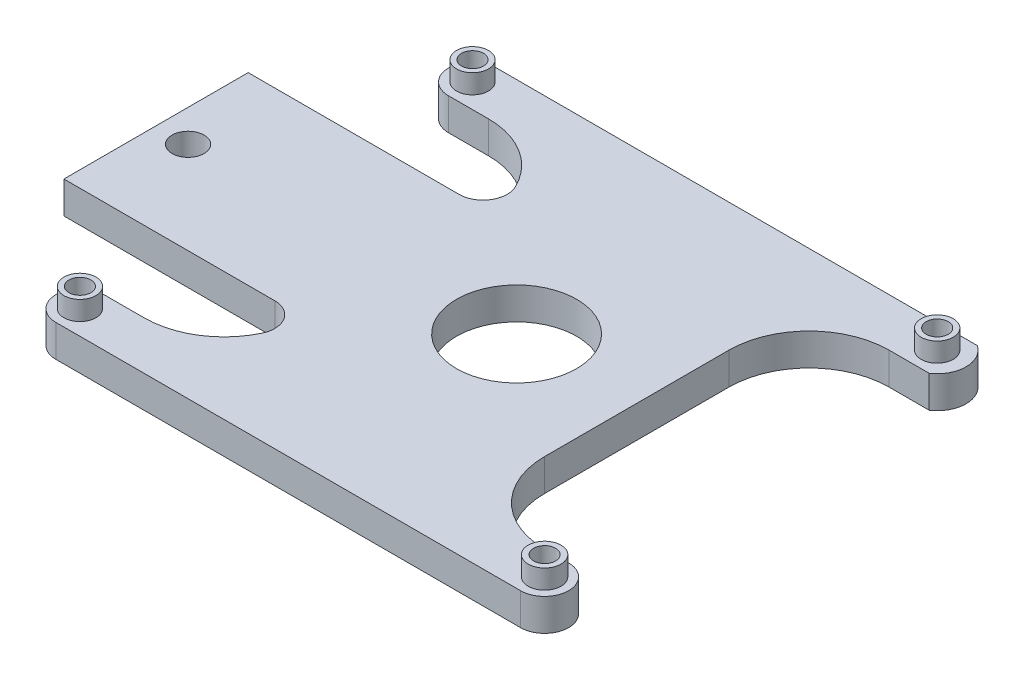
ISO-10303-21;
HEADER;
FILE_DESCRIPTION(('STEP AP214'),'2;1');
FILE_NAME('part.step','',(''),(''),'','','');
FILE_SCHEMA(('AUTOMOTIVE_DESIGN { 1 0 10303 214 1 1 1 1 }'));
ENDSEC;
DATA;
#1=APPLICATION_CONTEXT('core data for automotive mechanical design processes');
#2=APPLICATION_PROTOCOL_DEFINITION('international standard','automotive_design',2000,#1);
#3=PRODUCT_CONTEXT('',#1,'mechanical');
#4=PRODUCT('Part','Part','',(#3));
#5=PRODUCT_RELATED_PRODUCT_CATEGORY('part','',(#4));
#6=PRODUCT_DEFINITION_FORMATION('','',#4);
#7=PRODUCT_DEFINITION_CONTEXT('part definition',#1,'design');
#8=PRODUCT_DEFINITION('design','',#6,#7);
#9=PRODUCT_DEFINITION_SHAPE('','',#8);
#10=(LENGTH_UNIT() NAMED_UNIT(*) SI_UNIT(.MILLI.,.METRE.));
#11=(NAMED_UNIT(*) PLANE_ANGLE_UNIT() SI_UNIT($,.RADIAN.));
#12=(NAMED_UNIT(*) SI_UNIT($,.STERADIAN.) SOLID_ANGLE_UNIT());
#13=UNCERTAINTY_MEASURE_WITH_UNIT(LENGTH_MEASURE(1.E-05),#10,'distance_accuracy_value','');
#14=(GEOMETRIC_REPRESENTATION_CONTEXT(3) GLOBAL_UNCERTAINTY_ASSIGNED_CONTEXT((#13)) GLOBAL_UNIT_ASSIGNED_CONTEXT((#10,
#11,#12)) REPRESENTATION_CONTEXT('',''));
#15=CARTESIAN_POINT('',(0.,0.,0.));
#16=DIRECTION('',(0.,0.,1.));
#17=DIRECTION('',(1.,0.,0.));
#18=AXIS2_PLACEMENT_3D('',#15,#16,#17);
#19=CARTESIAN_POINT('',(0.,4.,0.));
#20=DIRECTION('',(0.,1.,0.));
#21=DIRECTION('',(0.,0.,1.));
#22=AXIS2_PLACEMENT_3D('',#19,#20,#21);
#23=PLANE('',#22);
#24=CARTESIAN_POINT('',(41.2403562828165,4.,9.44125715526372));
#25=DIRECTION('',(0.,1.,0.));
#26=DIRECTION('',(0.,0.,1.));
#27=AXIS2_PLACEMENT_3D('',#24,#25,#26);
#28=CIRCLE('',#27,2.05021911453277);
#29=CARTESIAN_POINT('',(41.2403562828165,4.,11.4914762697965));
#30=VERTEX_POINT('',#29);
#31=EDGE_CURVE('E370',#30,#30,#28,.T.);
#32=ORIENTED_EDGE('',*,*,#31,.F.);
#33=EDGE_LOOP('',(#32));
#34=FACE_BOUND('',#33,.T.);
#35=CARTESIAN_POINT('',(-16.7596437171835,4.,-39.5587428447363));
#36=DIRECTION('',(0.,1.,0.));
#37=DIRECTION('',(0.,0.,1.));
#38=AXIS2_PLACEMENT_3D('',#35,#36,#37);
#39=CIRCLE('',#38,1.9951056342779);
#40=CARTESIAN_POINT('',(-16.7596437171835,4.,-37.5636372104584));
#41=VERTEX_POINT('',#40);
#42=EDGE_CURVE('E388',#41,#41,#39,.T.);
#43=ORIENTED_EDGE('',*,*,#42,.F.);
#44=EDGE_LOOP('',(#43));
#45=FACE_BOUND('',#44,.T.);
#46=CARTESIAN_POINT('',(-27.7596437171835,4.,-15.0587428447362));
#47=DIRECTION('',(0.,1.,0.));
#48=DIRECTION('',(0.,0.,1.));
#49=AXIS2_PLACEMENT_3D('',#46,#47,#48);
#50=CIRCLE('',#49,2.00000000000001);
#51=CARTESIAN_POINT('',(-27.7596437171835,4.,-13.0587428447362));
#52=VERTEX_POINT('',#51);
#53=EDGE_CURVE('E392',#52,#52,#50,.T.);
#54=ORIENTED_EDGE('',*,*,#53,.F.);
#55=EDGE_LOOP('',(#54));
#56=FACE_BOUND('',#55,.T.);
#57=CARTESIAN_POINT('',(13.2403562828165,4.,-15.0587428447363));
#58=DIRECTION('',(0.,1.,0.));
#59=DIRECTION('',(0.,0.,1.));
#60=AXIS2_PLACEMENT_3D('',#57,#58,#59);
#61=CIRCLE('',#60,7.5);
#62=CARTESIAN_POINT('',(13.2403562828165,4.,-7.55874284473629));
#63=VERTEX_POINT('',#62);
#64=EDGE_CURVE('E275',#63,#63,#61,.T.);
#65=ORIENTED_EDGE('',*,*,#64,.F.);
#66=EDGE_LOOP('',(#65));
#67=FACE_BOUND('',#66,.T.);
#68=CARTESIAN_POINT('',(-11.7596437171835,4.,-26.5587428447363));
#69=DIRECTION('',(0.,1.,0.));
#70=DIRECTION('',(0.,0.,1.));
#71=AXIS2_PLACEMENT_3D('',#68,#69,#70);
#72=CIRCLE('',#71,10.);
#73=CARTESIAN_POINT('',(-2.72456468813099,4.,-30.8444571304505));
#74=VERTEX_POINT('',#73);
#75=CARTESIAN_POINT('',(-11.7596437171836,4.,-36.5587428447363));
#76=VERTEX_POINT('',#75);
#77=EDGE_CURVE('E399',#74,#76,#72,.T.);
#78=ORIENTED_EDGE('',*,*,#77,.F.);
#79=CARTESIAN_POINT('',(-5.43508839684676,4.,-29.5587428447362));
#80=DIRECTION('',(0.,1.,0.));
#81=DIRECTION('',(0.,0.,1.));
#82=AXIS2_PLACEMENT_3D('',#79,#80,#81);
#83=CIRCLE('',#82,3.);
#84=CARTESIAN_POINT('',(-5.43508839684676,4.,-26.5587428447362));
#85=VERTEX_POINT('',#84);
#86=EDGE_CURVE('E401',#74,#85,#83,.F.);
#87=ORIENTED_EDGE('',*,*,#86,.T.);
#88=DIRECTION('',(-1.,0.,0.));
#89=VECTOR('',#88,1.);
#90=CARTESIAN_POINT('',(0.,4.,-26.5587428447362));
#91=LINE('',#90,#89);
#92=CARTESIAN_POINT('',(-31.7596437171835,4.,-26.5587428447363));
#93=VERTEX_POINT('',#92);
#94=EDGE_CURVE('E316',#85,#93,#91,.T.);
#95=ORIENTED_EDGE('',*,*,#94,.T.);
#96=DIRECTION('',(0.,0.,-1.));
#97=VECTOR('',#96,1.);
#98=CARTESIAN_POINT('',(-31.7596437171835,4.,0.));
#99=LINE('',#98,#97);
#100=CARTESIAN_POINT('',(-31.7596437171835,4.,-3.55874284473629));
#101=VERTEX_POINT('',#100);
#102=EDGE_CURVE('E404',#101,#93,#99,.T.);
#103=ORIENTED_EDGE('',*,*,#102,.F.);
#104=DIRECTION('',(1.,0.,0.));
#105=VECTOR('',#104,1.);
#106=CARTESIAN_POINT('',(0.,4.,-3.55874284473629));
#107=LINE('',#106,#105);
#108=CARTESIAN_POINT('',(-5.43508839684676,4.,-3.55874284473635));
#109=VERTEX_POINT('',#108);
#110=EDGE_CURVE('E407',#101,#109,#107,.T.);
#111=ORIENTED_EDGE('',*,*,#110,.T.);
#112=CARTESIAN_POINT('',(-5.43508839684675,4.,-0.55874284473635));
#113=DIRECTION('',(0.,1.,0.));
#114=DIRECTION('',(0.,0.,1.));
#115=AXIS2_PLACEMENT_3D('',#112,#113,#114);
#116=CIRCLE('',#115,3.);
#117=CARTESIAN_POINT('',(-2.72456468813099,4.,0.726971440977909));
#118=VERTEX_POINT('',#117);
#119=EDGE_CURVE('E409',#118,#109,#116,.T.);
#120=ORIENTED_EDGE('',*,*,#119,.F.);
#121=CARTESIAN_POINT('',(-11.7596437171835,4.,-3.55874284473628));
#122=DIRECTION('',(0.,1.,0.));
#123=DIRECTION('',(0.,0.,1.));
#124=AXIS2_PLACEMENT_3D('',#121,#122,#123);
#125=CIRCLE('',#124,10.);
#126=CARTESIAN_POINT('',(-11.7596437171836,4.,6.44125715526371));
#127=VERTEX_POINT('',#126);
#128=EDGE_CURVE('E412',#127,#118,#125,.T.);
#129=ORIENTED_EDGE('',*,*,#128,.F.);
#130=DIRECTION('',(1.,0.,0.));
#131=VECTOR('',#130,1.);
#132=CARTESIAN_POINT('',(0.,4.,6.44125715526371));
#133=LINE('',#132,#131);
#134=CARTESIAN_POINT('',(-16.7596437171835,4.,6.44125715526371));
#135=VERTEX_POINT('',#134);
#136=EDGE_CURVE('E415',#135,#127,#133,.T.);
#137=ORIENTED_EDGE('',*,*,#136,.F.);
#138=CARTESIAN_POINT('',(-16.7596437171835,4.,9.44125715526371));
#139=DIRECTION('',(0.,1.,0.));
#140=DIRECTION('',(0.,0.,1.));
#141=AXIS2_PLACEMENT_3D('',#138,#139,#140);
#142=CIRCLE('',#141,3.);
#143=CARTESIAN_POINT('',(-16.7596437171835,4.,12.4412571552637));
#144=VERTEX_POINT('',#143);
#145=EDGE_CURVE('E418',#135,#144,#142,.T.);
#146=ORIENTED_EDGE('',*,*,#145,.T.);
#147=DIRECTION('',(1.,0.,0.));
#148=VECTOR('',#147,1.);
#149=CARTESIAN_POINT('',(0.,4.,12.4412571552637));
#150=LINE('',#149,#148);
#151=CARTESIAN_POINT('',(41.2403562828165,4.,12.4412571552637));
#152=VERTEX_POINT('',#151);
#153=EDGE_CURVE('E421',#144,#152,#150,.T.);
#154=ORIENTED_EDGE('',*,*,#153,.T.);
#155=CARTESIAN_POINT('',(41.2403562828165,4.,9.44125715526372));
#156=DIRECTION('',(0.,1.,0.));
#157=DIRECTION('',(0.,0.,1.));
#158=AXIS2_PLACEMENT_3D('',#155,#156,#157);
#159=CIRCLE('',#158,3.);
#160=CARTESIAN_POINT('',(41.2403562828165,4.,6.44125715526372));
#161=VERTEX_POINT('',#160);
#162=EDGE_CURVE('E424',#152,#161,#159,.T.);
#163=ORIENTED_EDGE('',*,*,#162,.T.);
#164=DIRECTION('',(1.,0.,0.));
#165=VECTOR('',#164,1.);
#166=CARTESIAN_POINT('',(0.,4.,6.44125715526369));
#167=LINE('',#166,#165);
#168=CARTESIAN_POINT('',(38.2403562828165,4.,6.44125715526372));
#169=VERTEX_POINT('',#168);
#170=EDGE_CURVE('E426',#169,#161,#167,.T.);
#171=ORIENTED_EDGE('',*,*,#170,.F.);
#172=CARTESIAN_POINT('',(38.2403562828165,4.,-3.55874284473628));
#173=DIRECTION('',(0.,1.,0.));
#174=DIRECTION('',(0.,0.,1.));
#175=AXIS2_PLACEMENT_3D('',#172,#173,#174);
#176=CIRCLE('',#175,10.);
#177=CARTESIAN_POINT('',(28.2403562828165,4.,-3.55874284473635));
#178=VERTEX_POINT('',#177);
#179=EDGE_CURVE('E429',#178,#169,#176,.T.);
#180=ORIENTED_EDGE('',*,*,#179,.F.);
#181=DIRECTION('',(0.,0.,1.));
#182=VECTOR('',#181,1.);
#183=CARTESIAN_POINT('',(28.2403562828165,4.,0.));
#184=LINE('',#183,#182);
#185=CARTESIAN_POINT('',(28.2403562828165,4.,-26.5587428447362));
#186=VERTEX_POINT('',#185);
#187=EDGE_CURVE('E432',#186,#178,#184,.T.);
#188=ORIENTED_EDGE('',*,*,#187,.F.);
#189=CARTESIAN_POINT('',(38.2403562828165,4.,-26.5587428447363));
#190=DIRECTION('',(0.,1.,0.));
#191=DIRECTION('',(0.,0.,1.));
#192=AXIS2_PLACEMENT_3D('',#189,#190,#191);
#193=CIRCLE('',#192,10.);
#194=CARTESIAN_POINT('',(38.2403562828165,4.,-36.5587428447363));
#195=VERTEX_POINT('',#194);
#196=EDGE_CURVE('E435',#186,#195,#193,.F.);
#197=ORIENTED_EDGE('',*,*,#196,.T.);
#198=DIRECTION('',(1.,0.,0.));
#199=VECTOR('',#198,1.);
#200=CARTESIAN_POINT('',(0.,4.,-36.5587428447363));
#201=LINE('',#200,#199);
#202=CARTESIAN_POINT('',(43.2403562828164,4.,-36.5587428447363));
#203=VERTEX_POINT('',#202);
#204=EDGE_CURVE('E201',#195,#203,#201,.T.);
#205=ORIENTED_EDGE('',*,*,#204,.T.);
#206=CARTESIAN_POINT('',(41.2403562828165,4.,-39.5587428447363));
#207=DIRECTION('',(0.,1.,0.));
#208=DIRECTION('',(0.,0.,1.));
#209=AXIS2_PLACEMENT_3D('',#206,#207,#208);
#210=CIRCLE('',#209,3.60555127546399);
#211=CARTESIAN_POINT('',(43.2403562828164,4.,-42.5587428447363));
#212=VERTEX_POINT('',#211);
#213=EDGE_CURVE('E198',#203,#212,#210,.T.);
#214=ORIENTED_EDGE('',*,*,#213,.T.);
#215=DIRECTION('',(1.,0.,0.));
#216=VECTOR('',#215,1.);
#217=CARTESIAN_POINT('',(0.,4.,-42.5587428447363));
#218=LINE('',#217,#216);
#219=CARTESIAN_POINT('',(-16.7596437171835,4.,-42.5587428447363));
#220=VERTEX_POINT('',#219);
#221=EDGE_CURVE('E184',#220,#212,#218,.T.);
#222=ORIENTED_EDGE('',*,*,#221,.F.);
#223=CARTESIAN_POINT('',(-16.7596437171835,4.,-39.5587428447363));
#224=DIRECTION('',(0.,1.,0.));
#225=DIRECTION('',(0.,0.,1.));
#226=AXIS2_PLACEMENT_3D('',#223,#224,#225);
#227=CIRCLE('',#226,3.);
#228=CARTESIAN_POINT('',(-16.7596437171835,4.,-36.5587428447363));
#229=VERTEX_POINT('',#228);
#230=EDGE_CURVE('E193',#220,#229,#227,.T.);
#231=ORIENTED_EDGE('',*,*,#230,.T.);
#232=DIRECTION('',(1.,0.,0.));
#233=VECTOR('',#232,1.);
#234=CARTESIAN_POINT('',(0.,4.,-36.5587428447363));
#235=LINE('',#234,#233);
#236=EDGE_CURVE('E53',#229,#76,#235,.T.);
#237=ORIENTED_EDGE('',*,*,#236,.T.);
#238=EDGE_LOOP('',(#78,#87,#95,#103,#111,#120,#129,#137,#146,#154,#163,#171,#180,#188,#197,#205,
#214,#222,#231,#237));
#239=FACE_BOUND('',#238,.T.);
#240=CARTESIAN_POINT('',(-16.7596437171835,4.,9.44125715526371));
#241=DIRECTION('',(0.,1.,0.));
#242=DIRECTION('',(0.,0.,1.));
#243=AXIS2_PLACEMENT_3D('',#240,#241,#242);
#244=CIRCLE('',#243,2.00188014294717);
#245=CARTESIAN_POINT('',(-16.7596437171835,4.,11.4431372982109));
#246=VERTEX_POINT('',#245);
#247=EDGE_CURVE('E379',#246,#246,#244,.T.);
#248=ORIENTED_EDGE('',*,*,#247,.F.);
#249=EDGE_LOOP('',(#248));
#250=FACE_BOUND('',#249,.T.);
#251=CARTESIAN_POINT('',(41.2403562828165,4.,-39.5587428447363));
#252=DIRECTION('',(0.,1.,0.));
#253=DIRECTION('',(0.,0.,1.));
#254=AXIS2_PLACEMENT_3D('',#251,#252,#253);
#255=CIRCLE('',#254,2.00232861180243);
#256=CARTESIAN_POINT('',(41.2403562828165,4.,-37.5564142329339));
#257=VERTEX_POINT('',#256);
#258=EDGE_CURVE('E359',#257,#257,#255,.T.);
#259=ORIENTED_EDGE('',*,*,#258,.F.);
#260=EDGE_LOOP('',(#259));
#261=FACE_BOUND('',#260,.T.);
#262=ADVANCED_FACE('F35',(#34,#45,#56,#67,#239,#250,#261),#23,.T.);
#263=CARTESIAN_POINT('',(-11.7596437171835,4.,-26.5587428447363));
#264=DIRECTION('',(0.,-1.,0.));
#265=DIRECTION('',(0.,0.,-1.));
#266=AXIS2_PLACEMENT_3D('',#263,#264,#265);
#267=CYLINDRICAL_SURFACE('',#266,10.);
#268=CARTESIAN_POINT('',(-11.7596437171835,0.,-26.5587428447363));
#269=DIRECTION('',(0.,1.,0.));
#270=DIRECTION('',(0.,0.,1.));
#271=AXIS2_PLACEMENT_3D('',#268,#269,#270);
#272=CIRCLE('',#271,10.);
#273=CARTESIAN_POINT('',(-2.72456468813099,0.,-30.8444571304505));
#274=VERTEX_POINT('',#273);
#275=CARTESIAN_POINT('',(-11.7596437171836,0.,-36.5587428447363));
#276=VERTEX_POINT('',#275);
#277=EDGE_CURVE('E221',#274,#276,#272,.T.);
#278=ORIENTED_EDGE('',*,*,#277,.F.);
#279=DIRECTION('',(0.,-1.,0.));
#280=VECTOR('',#279,1.);
#281=CARTESIAN_POINT('',(-2.72456468813099,4.,-30.8444571304505));
#282=LINE('',#281,#280);
#283=EDGE_CURVE('E11',#74,#274,#282,.T.);
#284=ORIENTED_EDGE('',*,*,#283,.F.);
#285=ORIENTED_EDGE('',*,*,#77,.T.);
#286=DIRECTION('',(0.,-1.,0.));
#287=VECTOR('',#286,1.);
#288=CARTESIAN_POINT('',(-11.7596437171836,4.,-36.5587428447363));
#289=LINE('',#288,#287);
#290=EDGE_CURVE('E124',#76,#276,#289,.T.);
#291=ORIENTED_EDGE('',*,*,#290,.T.);
#292=EDGE_LOOP('',(#278,#284,#285,#291));
#293=FACE_BOUND('',#292,.T.);
#294=ADVANCED_FACE('F322',(#293),#267,.F.);
#295=CARTESIAN_POINT('',(-5.43508839684676,4.,-29.5587428447362));
#296=DIRECTION('',(0.,-1.,0.));
#297=DIRECTION('',(0.,0.,-1.));
#298=AXIS2_PLACEMENT_3D('',#295,#296,#297);
#299=CYLINDRICAL_SURFACE('',#298,3.);
#300=CARTESIAN_POINT('',(-5.43508839684676,0.,-29.5587428447362));
#301=DIRECTION('',(0.,1.,0.));
#302=DIRECTION('',(0.,0.,1.));
#303=AXIS2_PLACEMENT_3D('',#300,#301,#302);
#304=CIRCLE('',#303,3.);
#305=CARTESIAN_POINT('',(-5.43508839684676,0.,-26.5587428447362));
#306=VERTEX_POINT('',#305);
#307=EDGE_CURVE('E223',#274,#306,#304,.F.);
#308=ORIENTED_EDGE('',*,*,#307,.T.);
#309=DIRECTION('',(0.,-1.,0.));
#310=VECTOR('',#309,1.);
#311=CARTESIAN_POINT('',(-5.43508839684676,4.,-26.5587428447362));
#312=LINE('',#311,#310);
#313=EDGE_CURVE('E45',#85,#306,#312,.T.);
#314=ORIENTED_EDGE('',*,*,#313,.F.);
#315=ORIENTED_EDGE('',*,*,#86,.F.);
#316=ORIENTED_EDGE('',*,*,#283,.T.);
#317=EDGE_LOOP('',(#308,#314,#315,#316));
#318=FACE_BOUND('',#317,.T.);
#319=ADVANCED_FACE('F320',(#318),#299,.F.);
#320=CARTESIAN_POINT('',(0.,4.,-26.5587428447362));
#321=DIRECTION('',(0.,0.,1.));
#322=DIRECTION('',(1.,0.,0.));
#323=AXIS2_PLACEMENT_3D('',#320,#321,#322);
#324=PLANE('',#323);
#325=DIRECTION('',(-1.,0.,0.));
#326=VECTOR('',#325,1.);
#327=CARTESIAN_POINT('',(0.,0.,-26.5587428447362));
#328=LINE('',#327,#326);
#329=CARTESIAN_POINT('',(-31.7596437171835,0.,-26.5587428447363));
#330=VERTEX_POINT('',#329);
#331=EDGE_CURVE('E226',#306,#330,#328,.T.);
#332=ORIENTED_EDGE('',*,*,#331,.T.);
#333=DIRECTION('',(0.,-1.,0.));
#334=VECTOR('',#333,1.);
#335=CARTESIAN_POINT('',(-31.7596437171835,4.,-26.5587428447363));
#336=LINE('',#335,#334);
#337=EDGE_CURVE('E309',#93,#330,#336,.T.);
#338=ORIENTED_EDGE('',*,*,#337,.F.);
#339=ORIENTED_EDGE('',*,*,#94,.F.);
#340=ORIENTED_EDGE('',*,*,#313,.T.);
#341=EDGE_LOOP('',(#332,#338,#339,#340));
#342=FACE_BOUND('',#341,.T.);
#343=ADVANCED_FACE('F314',(#342),#324,.F.);
#344=CARTESIAN_POINT('',(-31.7596437171835,4.,0.));
#345=DIRECTION('',(-1.,0.,0.));
#346=DIRECTION('',(0.,0.,1.));
#347=AXIS2_PLACEMENT_3D('',#344,#345,#346);
#348=PLANE('',#347);
#349=DIRECTION('',(0.,0.,-1.));
#350=VECTOR('',#349,1.);
#351=CARTESIAN_POINT('',(-31.7596437171835,0.,0.));
#352=LINE('',#351,#350);
#353=CARTESIAN_POINT('',(-31.7596437171835,0.,-3.55874284473629));
#354=VERTEX_POINT('',#353);
#355=EDGE_CURVE('E229',#354,#330,#352,.T.);
#356=ORIENTED_EDGE('',*,*,#355,.F.);
#357=DIRECTION('',(0.,-1.,0.));
#358=VECTOR('',#357,1.);
#359=CARTESIAN_POINT('',(-31.7596437171835,4.,-3.55874284473629));
#360=LINE('',#359,#358);
#361=EDGE_CURVE('E307',#101,#354,#360,.T.);
#362=ORIENTED_EDGE('',*,*,#361,.F.);
#363=ORIENTED_EDGE('',*,*,#102,.T.);
#364=ORIENTED_EDGE('',*,*,#337,.T.);
#365=EDGE_LOOP('',(#356,#362,#363,#364));
#366=FACE_BOUND('',#365,.T.);
#367=ADVANCED_FACE('F489',(#366),#348,.T.);
#368=CARTESIAN_POINT('',(0.,4.,-3.55874284473629));
#369=DIRECTION('',(0.,0.,-1.));
#370=DIRECTION('',(-1.,0.,0.));
#371=AXIS2_PLACEMENT_3D('',#368,#369,#370);
#372=PLANE('',#371);
#373=DIRECTION('',(1.,0.,0.));
#374=VECTOR('',#373,1.);
#375=CARTESIAN_POINT('',(0.,0.,-3.55874284473629));
#376=LINE('',#375,#374);
#377=CARTESIAN_POINT('',(-5.43508839684676,0.,-3.55874284473635));
#378=VERTEX_POINT('',#377);
#379=EDGE_CURVE('E232',#354,#378,#376,.T.);
#380=ORIENTED_EDGE('',*,*,#379,.T.);
#381=DIRECTION('',(0.,-1.,0.));
#382=VECTOR('',#381,1.);
#383=CARTESIAN_POINT('',(-5.43508839684676,4.,-3.55874284473635));
#384=LINE('',#383,#382);
#385=EDGE_CURVE('E305',#109,#378,#384,.T.);
#386=ORIENTED_EDGE('',*,*,#385,.F.);
#387=ORIENTED_EDGE('',*,*,#110,.F.);
#388=ORIENTED_EDGE('',*,*,#361,.T.);
#389=EDGE_LOOP('',(#380,#386,#387,#388));
#390=FACE_BOUND('',#389,.T.);
#391=ADVANCED_FACE('F486',(#390),#372,.F.);
#392=CARTESIAN_POINT('',(-5.43508839684675,4.,-0.55874284473635));
#393=DIRECTION('',(0.,-1.,0.));
#394=DIRECTION('',(0.,0.,-1.));
#395=AXIS2_PLACEMENT_3D('',#392,#393,#394);
#396=CYLINDRICAL_SURFACE('',#395,3.);
#397=CARTESIAN_POINT('',(-5.43508839684675,0.,-0.55874284473635));
#398=DIRECTION('',(0.,1.,0.));
#399=DIRECTION('',(0.,0.,1.));
#400=AXIS2_PLACEMENT_3D('',#397,#398,#399);
#401=CIRCLE('',#400,3.);
#402=CARTESIAN_POINT('',(-2.72456468813099,0.,0.726971440977909));
#403=VERTEX_POINT('',#402);
#404=EDGE_CURVE('E235',#403,#378,#401,.T.);
#405=ORIENTED_EDGE('',*,*,#404,.F.);
#406=DIRECTION('',(0.,-1.,0.));
#407=VECTOR('',#406,1.);
#408=CARTESIAN_POINT('',(-2.72456468813099,4.,0.726971440977909));
#409=LINE('',#408,#407);
#410=EDGE_CURVE('E303',#118,#403,#409,.T.);
#411=ORIENTED_EDGE('',*,*,#410,.F.);
#412=ORIENTED_EDGE('',*,*,#119,.T.);
#413=ORIENTED_EDGE('',*,*,#385,.T.);
#414=EDGE_LOOP('',(#405,#411,#412,#413));
#415=FACE_BOUND('',#414,.T.);
#416=ADVANCED_FACE('F482',(#415),#396,.F.);
#417=CARTESIAN_POINT('',(-11.7596437171835,4.,-3.55874284473628));
#418=DIRECTION('',(0.,-1.,0.));
#419=DIRECTION('',(0.,0.,-1.));
#420=AXIS2_PLACEMENT_3D('',#417,#418,#419);
#421=CYLINDRICAL_SURFACE('',#420,10.);
#422=CARTESIAN_POINT('',(-11.7596437171835,0.,-3.55874284473628));
#423=DIRECTION('',(0.,1.,0.));
#424=DIRECTION('',(0.,0.,1.));
#425=AXIS2_PLACEMENT_3D('',#422,#423,#424);
#426=CIRCLE('',#425,10.);
#427=CARTESIAN_POINT('',(-11.7596437171836,0.,6.44125715526371));
#428=VERTEX_POINT('',#427);
#429=EDGE_CURVE('E238',#428,#403,#426,.T.);
#430=ORIENTED_EDGE('',*,*,#429,.F.);
#431=DIRECTION('',(0.,-1.,0.));
#432=VECTOR('',#431,1.);
#433=CARTESIAN_POINT('',(-11.7596437171836,4.,6.44125715526371));
#434=LINE('',#433,#432);
#435=EDGE_CURVE('E301',#127,#428,#434,.T.);
#436=ORIENTED_EDGE('',*,*,#435,.F.);
#437=ORIENTED_EDGE('',*,*,#128,.T.);
#438=ORIENTED_EDGE('',*,*,#410,.T.);
#439=EDGE_LOOP('',(#430,#436,#437,#438));
#440=FACE_BOUND('',#439,.T.);
#441=ADVANCED_FACE('F478',(#440),#421,.F.);
#442=CARTESIAN_POINT('',(0.,4.,6.44125715526371));
#443=DIRECTION('',(0.,0.,-1.));
#444=DIRECTION('',(-1.,0.,0.));
#445=AXIS2_PLACEMENT_3D('',#442,#443,#444);
#446=PLANE('',#445);
#447=DIRECTION('',(1.,0.,0.));
#448=VECTOR('',#447,1.);
#449=CARTESIAN_POINT('',(0.,0.,6.44125715526371));
#450=LINE('',#449,#448);
#451=CARTESIAN_POINT('',(-16.7596437171835,0.,6.44125715526371));
#452=VERTEX_POINT('',#451);
#453=EDGE_CURVE('E241',#452,#428,#450,.T.);
#454=ORIENTED_EDGE('',*,*,#453,.F.);
#455=DIRECTION('',(0.,-1.,0.));
#456=VECTOR('',#455,1.);
#457=CARTESIAN_POINT('',(-16.7596437171835,4.,6.44125715526371));
#458=LINE('',#457,#456);
#459=EDGE_CURVE('E299',#135,#452,#458,.T.);
#460=ORIENTED_EDGE('',*,*,#459,.F.);
#461=ORIENTED_EDGE('',*,*,#136,.T.);
#462=ORIENTED_EDGE('',*,*,#435,.T.);
#463=EDGE_LOOP('',(#454,#460,#461,#462));
#464=FACE_BOUND('',#463,.T.);
#465=ADVANCED_FACE('F473',(#464),#446,.T.);
#466=CARTESIAN_POINT('',(-16.7596437171835,4.,9.44125715526371));
#467=DIRECTION('',(0.,-1.,0.));
#468=DIRECTION('',(0.,0.,-1.));
#469=AXIS2_PLACEMENT_3D('',#466,#467,#468);
#470=CYLINDRICAL_SURFACE('',#469,3.);
#471=CARTESIAN_POINT('',(-16.7596437171835,0.,9.44125715526371));
#472=DIRECTION('',(0.,1.,0.));
#473=DIRECTION('',(0.,0.,1.));
#474=AXIS2_PLACEMENT_3D('',#471,#472,#473);
#475=CIRCLE('',#474,3.);
#476=CARTESIAN_POINT('',(-16.7596437171835,0.,12.4412571552637));
#477=VERTEX_POINT('',#476);
#478=EDGE_CURVE('E244',#452,#477,#475,.T.);
#479=ORIENTED_EDGE('',*,*,#478,.T.);
#480=DIRECTION('',(0.,-1.,0.));
#481=VECTOR('',#480,1.);
#482=CARTESIAN_POINT('',(-16.7596437171835,4.,12.4412571552637));
#483=LINE('',#482,#481);
#484=EDGE_CURVE('E296',#144,#477,#483,.T.);
#485=ORIENTED_EDGE('',*,*,#484,.F.);
#486=ORIENTED_EDGE('',*,*,#145,.F.);
#487=ORIENTED_EDGE('',*,*,#459,.T.);
#488=EDGE_LOOP('',(#479,#485,#486,#487));
#489=FACE_BOUND('',#488,.T.);
#490=ADVANCED_FACE('F470',(#489),#470,.T.);
#491=CARTESIAN_POINT('',(0.,4.,12.4412571552637));
#492=DIRECTION('',(0.,0.,-1.));
#493=DIRECTION('',(-1.,0.,0.));
#494=AXIS2_PLACEMENT_3D('',#491,#492,#493);
#495=PLANE('',#494);
#496=DIRECTION('',(1.,0.,0.));
#497=VECTOR('',#496,1.);
#498=CARTESIAN_POINT('',(0.,0.,12.4412571552637));
#499=LINE('',#498,#497);
#500=CARTESIAN_POINT('',(41.2403562828165,0.,12.4412571552637));
#501=VERTEX_POINT('',#500);
#502=EDGE_CURVE('E247',#477,#501,#499,.T.);
#503=ORIENTED_EDGE('',*,*,#502,.T.);
#504=DIRECTION('',(0.,-1.,0.));
#505=VECTOR('',#504,1.);
#506=CARTESIAN_POINT('',(41.2403562828165,4.,12.4412571552637));
#507=LINE('',#506,#505);
#508=EDGE_CURVE('E293',#152,#501,#507,.T.);
#509=ORIENTED_EDGE('',*,*,#508,.F.);
#510=ORIENTED_EDGE('',*,*,#153,.F.);
#511=ORIENTED_EDGE('',*,*,#484,.T.);
#512=EDGE_LOOP('',(#503,#509,#510,#511));
#513=FACE_BOUND('',#512,.T.);
#514=ADVANCED_FACE('F467',(#513),#495,.F.);
#515=CARTESIAN_POINT('',(41.2403562828165,4.,9.44125715526372));
#516=DIRECTION('',(0.,-1.,0.));
#517=DIRECTION('',(0.,0.,-1.));
#518=AXIS2_PLACEMENT_3D('',#515,#516,#517);
#519=CYLINDRICAL_SURFACE('',#518,3.);
#520=CARTESIAN_POINT('',(41.2403562828165,0.,9.44125715526372));
#521=DIRECTION('',(0.,1.,0.));
#522=DIRECTION('',(0.,0.,1.));
#523=AXIS2_PLACEMENT_3D('',#520,#521,#522);
#524=CIRCLE('',#523,3.);
#525=CARTESIAN_POINT('',(41.2403562828165,0.,6.44125715526372));
#526=VERTEX_POINT('',#525);
#527=EDGE_CURVE('E250',#501,#526,#524,.T.);
#528=ORIENTED_EDGE('',*,*,#527,.T.);
#529=DIRECTION('',(0.,-1.,0.));
#530=VECTOR('',#529,1.);
#531=CARTESIAN_POINT('',(41.2403562828165,4.,6.44125715526372));
#532=LINE('',#531,#530);
#533=EDGE_CURVE('E291',#161,#526,#532,.T.);
#534=ORIENTED_EDGE('',*,*,#533,.F.);
#535=ORIENTED_EDGE('',*,*,#162,.F.);
#536=ORIENTED_EDGE('',*,*,#508,.T.);
#537=EDGE_LOOP('',(#528,#534,#535,#536));
#538=FACE_BOUND('',#537,.T.);
#539=ADVANCED_FACE('F461',(#538),#519,.T.);
#540=CARTESIAN_POINT('',(0.,4.,6.44125715526369));
#541=DIRECTION('',(0.,0.,-1.));
#542=DIRECTION('',(-1.,0.,0.));
#543=AXIS2_PLACEMENT_3D('',#540,#541,#542);
#544=PLANE('',#543);
#545=DIRECTION('',(1.,0.,0.));
#546=VECTOR('',#545,1.);
#547=CARTESIAN_POINT('',(0.,0.,6.44125715526369));
#548=LINE('',#547,#546);
#549=CARTESIAN_POINT('',(38.2403562828165,0.,6.44125715526372));
#550=VERTEX_POINT('',#549);
#551=EDGE_CURVE('E253',#550,#526,#548,.T.);
#552=ORIENTED_EDGE('',*,*,#551,.F.);
#553=DIRECTION('',(0.,-1.,0.));
#554=VECTOR('',#553,1.);
#555=CARTESIAN_POINT('',(38.2403562828165,4.,6.44125715526372));
#556=LINE('',#555,#554);
#557=EDGE_CURVE('E289',#169,#550,#556,.T.);
#558=ORIENTED_EDGE('',*,*,#557,.F.);
#559=ORIENTED_EDGE('',*,*,#170,.T.);
#560=ORIENTED_EDGE('',*,*,#533,.T.);
#561=EDGE_LOOP('',(#552,#558,#559,#560));
#562=FACE_BOUND('',#561,.T.);
#563=ADVANCED_FACE('F458',(#562),#544,.T.);
#564=CARTESIAN_POINT('',(38.2403562828165,4.,-3.55874284473628));
#565=DIRECTION('',(0.,-1.,0.));
#566=DIRECTION('',(0.,0.,-1.));
#567=AXIS2_PLACEMENT_3D('',#564,#565,#566);
#568=CYLINDRICAL_SURFACE('',#567,10.);
#569=CARTESIAN_POINT('',(38.2403562828165,0.,-3.55874284473628));
#570=DIRECTION('',(0.,1.,0.));
#571=DIRECTION('',(0.,0.,1.));
#572=AXIS2_PLACEMENT_3D('',#569,#570,#571);
#573=CIRCLE('',#572,10.);
#574=CARTESIAN_POINT('',(28.2403562828165,0.,-3.55874284473635));
#575=VERTEX_POINT('',#574);
#576=EDGE_CURVE('E256',#575,#550,#573,.T.);
#577=ORIENTED_EDGE('',*,*,#576,.F.);
#578=DIRECTION('',(0.,-1.,0.));
#579=VECTOR('',#578,1.);
#580=CARTESIAN_POINT('',(28.2403562828165,4.,-3.55874284473635));
#581=LINE('',#580,#579);
#582=EDGE_CURVE('E287',#178,#575,#581,.T.);
#583=ORIENTED_EDGE('',*,*,#582,.F.);
#584=ORIENTED_EDGE('',*,*,#179,.T.);
#585=ORIENTED_EDGE('',*,*,#557,.T.);
#586=EDGE_LOOP('',(#577,#583,#584,#585));
#587=FACE_BOUND('',#586,.T.);
#588=ADVANCED_FACE('F454',(#587),#568,.F.);
#589=CARTESIAN_POINT('',(28.2403562828165,4.,0.));
#590=DIRECTION('',(1.,0.,0.));
#591=DIRECTION('',(0.,0.,-1.));
#592=AXIS2_PLACEMENT_3D('',#589,#590,#591);
#593=PLANE('',#592);
#594=DIRECTION('',(0.,0.,1.));
#595=VECTOR('',#594,1.);
#596=CARTESIAN_POINT('',(28.2403562828165,0.,0.));
#597=LINE('',#596,#595);
#598=CARTESIAN_POINT('',(28.2403562828165,0.,-26.5587428447362));
#599=VERTEX_POINT('',#598);
#600=EDGE_CURVE('E259',#599,#575,#597,.T.);
#601=ORIENTED_EDGE('',*,*,#600,.F.);
#602=DIRECTION('',(0.,-1.,0.));
#603=VECTOR('',#602,1.);
#604=CARTESIAN_POINT('',(28.2403562828165,4.,-26.5587428447362));
#605=LINE('',#604,#603);
#606=EDGE_CURVE('E285',#186,#599,#605,.T.);
#607=ORIENTED_EDGE('',*,*,#606,.F.);
#608=ORIENTED_EDGE('',*,*,#187,.T.);
#609=ORIENTED_EDGE('',*,*,#582,.T.);
#610=EDGE_LOOP('',(#601,#607,#608,#609));
#611=FACE_BOUND('',#610,.T.);
#612=ADVANCED_FACE('F450',(#611),#593,.T.);
#613=CARTESIAN_POINT('',(38.2403562828165,4.,-26.5587428447363));
#614=DIRECTION('',(0.,-1.,0.));
#615=DIRECTION('',(0.,0.,-1.));
#616=AXIS2_PLACEMENT_3D('',#613,#614,#615);
#617=CYLINDRICAL_SURFACE('',#616,10.);
#618=CARTESIAN_POINT('',(38.2403562828165,0.,-26.5587428447363));
#619=DIRECTION('',(0.,1.,0.));
#620=DIRECTION('',(0.,0.,1.));
#621=AXIS2_PLACEMENT_3D('',#618,#619,#620);
#622=CIRCLE('',#621,10.);
#623=CARTESIAN_POINT('',(38.2403562828165,0.,-36.5587428447363));
#624=VERTEX_POINT('',#623);
#625=EDGE_CURVE('E262',#599,#624,#622,.F.);
#626=ORIENTED_EDGE('',*,*,#625,.T.);
#627=DIRECTION('',(0.,-1.,0.));
#628=VECTOR('',#627,1.);
#629=CARTESIAN_POINT('',(38.2403562828165,4.,-36.5587428447363));
#630=LINE('',#629,#628);
#631=EDGE_CURVE('E282',#195,#624,#630,.T.);
#632=ORIENTED_EDGE('',*,*,#631,.F.);
#633=ORIENTED_EDGE('',*,*,#196,.F.);
#634=ORIENTED_EDGE('',*,*,#606,.T.);
#635=EDGE_LOOP('',(#626,#632,#633,#634));
#636=FACE_BOUND('',#635,.T.);
#637=ADVANCED_FACE('F448',(#636),#617,.F.);
#638=CARTESIAN_POINT('',(0.,4.,-36.5587428447363));
#639=DIRECTION('',(0.,0.,-1.));
#640=DIRECTION('',(-1.,0.,0.));
#641=AXIS2_PLACEMENT_3D('',#638,#639,#640);
#642=PLANE('',#641);
#643=DIRECTION('',(1.,0.,0.));
#644=VECTOR('',#643,1.);
#645=CARTESIAN_POINT('',(0.,0.,-36.5587428447363));
#646=LINE('',#645,#644);
#647=CARTESIAN_POINT('',(43.2403562828164,0.,-36.5587428447363));
#648=VERTEX_POINT('',#647);
#649=EDGE_CURVE('E265',#624,#648,#646,.T.);
#650=ORIENTED_EDGE('',*,*,#649,.T.);
#651=DIRECTION('',(0.,-1.,0.));
#652=VECTOR('',#651,1.);
#653=CARTESIAN_POINT('',(43.2403562828164,4.,-36.5587428447363));
#654=LINE('',#653,#652);
#655=EDGE_CURVE('E279',#203,#648,#654,.T.);
#656=ORIENTED_EDGE('',*,*,#655,.F.);
#657=ORIENTED_EDGE('',*,*,#204,.F.);
#658=ORIENTED_EDGE('',*,*,#631,.T.);
#659=EDGE_LOOP('',(#650,#656,#657,#658));
#660=FACE_BOUND('',#659,.T.);
#661=ADVANCED_FACE('F442',(#660),#642,.F.);
#662=CARTESIAN_POINT('',(41.2403562828165,4.,-39.5587428447363));
#663=DIRECTION('',(0.,-1.,0.));
#664=DIRECTION('',(0.,0.,-1.));
#665=AXIS2_PLACEMENT_3D('',#662,#663,#664);
#666=CYLINDRICAL_SURFACE('',#665,3.60555127546399);
#667=CARTESIAN_POINT('',(41.2403562828165,0.,-39.5587428447363));
#668=DIRECTION('',(0.,1.,0.));
#669=DIRECTION('',(0.,0.,1.));
#670=AXIS2_PLACEMENT_3D('',#667,#668,#669);
#671=CIRCLE('',#670,3.60555127546399);
#672=CARTESIAN_POINT('',(43.2403562828164,0.,-42.5587428447363));
#673=VERTEX_POINT('',#672);
#674=EDGE_CURVE('E268',#648,#673,#671,.T.);
#675=ORIENTED_EDGE('',*,*,#674,.T.);
#676=DIRECTION('',(0.,-1.,0.));
#677=VECTOR('',#676,1.);
#678=CARTESIAN_POINT('',(43.2403562828164,4.,-42.5587428447363));
#679=LINE('',#678,#677);
#680=EDGE_CURVE('E189',#212,#673,#679,.T.);
#681=ORIENTED_EDGE('',*,*,#680,.F.);
#682=ORIENTED_EDGE('',*,*,#213,.F.);
#683=ORIENTED_EDGE('',*,*,#655,.T.);
#684=EDGE_LOOP('',(#675,#681,#682,#683));
#685=FACE_BOUND('',#684,.T.);
#686=ADVANCED_FACE('F444',(#685),#666,.T.);
#687=CARTESIAN_POINT('',(0.,4.,-42.5587428447363));
#688=DIRECTION('',(0.,0.,-1.));
#689=DIRECTION('',(-1.,0.,0.));
#690=AXIS2_PLACEMENT_3D('',#687,#688,#689);
#691=PLANE('',#690);
#692=DIRECTION('',(1.,0.,0.));
#693=VECTOR('',#692,1.);
#694=CARTESIAN_POINT('',(0.,0.,-42.5587428447363));
#695=LINE('',#694,#693);
#696=CARTESIAN_POINT('',(-16.7596437171835,0.,-42.5587428447363));
#697=VERTEX_POINT('',#696);
#698=EDGE_CURVE('E186',#697,#673,#695,.T.);
#699=ORIENTED_EDGE('',*,*,#698,.F.);
#700=DIRECTION('',(0.,-1.,0.));
#701=VECTOR('',#700,1.);
#702=CARTESIAN_POINT('',(-16.7596437171835,4.,-42.5587428447363));
#703=LINE('',#702,#701);
#704=EDGE_CURVE('E180',#220,#697,#703,.T.);
#705=ORIENTED_EDGE('',*,*,#704,.F.);
#706=ORIENTED_EDGE('',*,*,#221,.T.);
#707=ORIENTED_EDGE('',*,*,#680,.T.);
#708=EDGE_LOOP('',(#699,#705,#706,#707));
#709=FACE_BOUND('',#708,.T.);
#710=ADVANCED_FACE('F182',(#709),#691,.T.);
#711=CARTESIAN_POINT('',(-16.7596437171835,4.,-39.5587428447363));
#712=DIRECTION('',(0.,-1.,0.));
#713=DIRECTION('',(0.,0.,-1.));
#714=AXIS2_PLACEMENT_3D('',#711,#712,#713);
#715=CYLINDRICAL_SURFACE('',#714,3.);
#716=CARTESIAN_POINT('',(-16.7596437171835,0.,-39.5587428447363));
#717=DIRECTION('',(0.,1.,0.));
#718=DIRECTION('',(0.,0.,1.));
#719=AXIS2_PLACEMENT_3D('',#716,#717,#718);
#720=CIRCLE('',#719,3.);
#721=CARTESIAN_POINT('',(-16.7596437171835,0.,-36.5587428447363));
#722=VERTEX_POINT('',#721);
#723=EDGE_CURVE('E272',#697,#722,#720,.T.);
#724=ORIENTED_EDGE('',*,*,#723,.T.);
#725=DIRECTION('',(0.,-1.,0.));
#726=VECTOR('',#725,1.);
#727=CARTESIAN_POINT('',(-16.7596437171835,4.,-36.5587428447363));
#728=LINE('',#727,#726);
#729=EDGE_CURVE('E190',#229,#722,#728,.T.);
#730=ORIENTED_EDGE('',*,*,#729,.F.);
#731=ORIENTED_EDGE('',*,*,#230,.F.);
#732=ORIENTED_EDGE('',*,*,#704,.T.);
#733=EDGE_LOOP('',(#724,#730,#731,#732));
#734=FACE_BOUND('',#733,.T.);
#735=ADVANCED_FACE('F194',(#734),#715,.T.);
#736=CARTESIAN_POINT('',(13.2403562828165,4.,-15.0587428447363));
#737=DIRECTION('',(0.,-1.,0.));
#738=DIRECTION('',(0.,0.,-1.));
#739=AXIS2_PLACEMENT_3D('',#736,#737,#738);
#740=CYLINDRICAL_SURFACE('',#739,7.5);
#741=ORIENTED_EDGE('',*,*,#64,.T.);
#742=EDGE_LOOP('',(#741));
#743=FACE_BOUND('',#742,.T.);
#744=CARTESIAN_POINT('',(13.2403562828165,0.,-15.0587428447363));
#745=DIRECTION('',(0.,1.,0.));
#746=DIRECTION('',(0.,0.,1.));
#747=AXIS2_PLACEMENT_3D('',#744,#745,#746);
#748=CIRCLE('',#747,7.5);
#749=CARTESIAN_POINT('',(13.2403562828165,0.,-7.55874284473629));
#750=VERTEX_POINT('',#749);
#751=EDGE_CURVE('E218',#750,#750,#748,.T.);
#752=ORIENTED_EDGE('',*,*,#751,.F.);
#753=EDGE_LOOP('',(#752));
#754=FACE_BOUND('',#753,.T.);
#755=ADVANCED_FACE('F334',(#743,#754),#740,.F.);
#756=CARTESIAN_POINT('',(-16.7596437171835,4.,9.44125715526371));
#757=DIRECTION('',(0.,-1.,0.));
#758=DIRECTION('',(0.,0.,-1.));
#759=AXIS2_PLACEMENT_3D('',#756,#757,#758);
#760=CYLINDRICAL_SURFACE('',#759,1.375);
#761=CARTESIAN_POINT('',(-16.7596437171835,0.,9.44125715526371));
#762=DIRECTION('',(0.,1.,0.));
#763=DIRECTION('',(0.,0.,1.));
#764=AXIS2_PLACEMENT_3D('',#761,#762,#763);
#765=CIRCLE('',#764,1.375);
#766=CARTESIAN_POINT('',(-16.7596437171835,0.,10.8162571552637));
#767=VERTEX_POINT('',#766);
#768=EDGE_CURVE('E215',#767,#767,#765,.T.);
#769=ORIENTED_EDGE('',*,*,#768,.F.);
#770=EDGE_LOOP('',(#769));
#771=FACE_BOUND('',#770,.T.);
#772=CARTESIAN_POINT('',(-16.7596437171835,6.4,9.44125715526371));
#773=DIRECTION('',(0.,1.,0.));
#774=DIRECTION('',(0.,0.,1.));
#775=AXIS2_PLACEMENT_3D('',#772,#773,#774);
#776=CIRCLE('',#775,1.375);
#777=CARTESIAN_POINT('',(-16.7596437171835,6.4,10.8162571552637));
#778=VERTEX_POINT('',#777);
#779=EDGE_CURVE('E374',#778,#778,#776,.T.);
#780=ORIENTED_EDGE('',*,*,#779,.T.);
#781=EDGE_LOOP('',(#780));
#782=FACE_BOUND('',#781,.T.);
#783=ADVANCED_FACE('F337',(#771,#782),#760,.F.);
#784=CARTESIAN_POINT('',(41.2403562828165,4.,9.44125715526372));
#785=DIRECTION('',(0.,-1.,0.));
#786=DIRECTION('',(0.,0.,-1.));
#787=AXIS2_PLACEMENT_3D('',#784,#785,#786);
#788=CYLINDRICAL_SURFACE('',#787,1.375);
#789=CARTESIAN_POINT('',(41.2403562828165,0.,9.44125715526372));
#790=DIRECTION('',(0.,1.,0.));
#791=DIRECTION('',(0.,0.,1.));
#792=AXIS2_PLACEMENT_3D('',#789,#790,#791);
#793=CIRCLE('',#792,1.375);
#794=CARTESIAN_POINT('',(41.2403562828165,0.,10.8162571552637));
#795=VERTEX_POINT('',#794);
#796=EDGE_CURVE('E212',#795,#795,#793,.T.);
#797=ORIENTED_EDGE('',*,*,#796,.F.);
#798=EDGE_LOOP('',(#797));
#799=FACE_BOUND('',#798,.T.);
#800=CARTESIAN_POINT('',(41.2403562828165,6.4,9.44125715526372));
#801=DIRECTION('',(0.,1.,0.));
#802=DIRECTION('',(0.,0.,1.));
#803=AXIS2_PLACEMENT_3D('',#800,#801,#802);
#804=CIRCLE('',#803,1.375);
#805=CARTESIAN_POINT('',(41.2403562828165,6.4,10.8162571552637));
#806=VERTEX_POINT('',#805);
#807=EDGE_CURVE('E366',#806,#806,#804,.T.);
#808=ORIENTED_EDGE('',*,*,#807,.T.);
#809=EDGE_LOOP('',(#808));
#810=FACE_BOUND('',#809,.T.);
#811=ADVANCED_FACE('F341',(#799,#810),#788,.F.);
#812=CARTESIAN_POINT('',(41.2403562828165,4.,-39.5587428447363));
#813=DIRECTION('',(0.,-1.,0.));
#814=DIRECTION('',(0.,0.,-1.));
#815=AXIS2_PLACEMENT_3D('',#812,#813,#814);
#816=CYLINDRICAL_SURFACE('',#815,1.375);
#817=CARTESIAN_POINT('',(41.2403562828165,0.,-39.5587428447363));
#818=DIRECTION('',(0.,1.,0.));
#819=DIRECTION('',(0.,0.,1.));
#820=AXIS2_PLACEMENT_3D('',#817,#818,#819);
#821=CIRCLE('',#820,1.375);
#822=CARTESIAN_POINT('',(41.2403562828165,0.,-38.1837428447363));
#823=VERTEX_POINT('',#822);
#824=EDGE_CURVE('E209',#823,#823,#821,.T.);
#825=ORIENTED_EDGE('',*,*,#824,.F.);
#826=EDGE_LOOP('',(#825));
#827=FACE_BOUND('',#826,.T.);
#828=CARTESIAN_POINT('',(41.2403562828165,6.4,-39.5587428447363));
#829=DIRECTION('',(0.,1.,0.));
#830=DIRECTION('',(0.,0.,1.));
#831=AXIS2_PLACEMENT_3D('',#828,#829,#830);
#832=CIRCLE('',#831,1.375);
#833=CARTESIAN_POINT('',(41.2403562828165,6.4,-38.1837428447363));
#834=VERTEX_POINT('',#833);
#835=EDGE_CURVE('E357',#834,#834,#832,.T.);
#836=ORIENTED_EDGE('',*,*,#835,.T.);
#837=EDGE_LOOP('',(#836));
#838=FACE_BOUND('',#837,.T.);
#839=ADVANCED_FACE('F344',(#827,#838),#816,.F.);
#840=CARTESIAN_POINT('',(-16.7596437171835,4.,-39.5587428447363));
#841=DIRECTION('',(0.,-1.,0.));
#842=DIRECTION('',(0.,0.,-1.));
#843=AXIS2_PLACEMENT_3D('',#840,#841,#842);
#844=CYLINDRICAL_SURFACE('',#843,1.37499999999999);
#845=CARTESIAN_POINT('',(-16.7596437171835,0.,-39.5587428447363));
#846=DIRECTION('',(0.,1.,0.));
#847=DIRECTION('',(0.,0.,1.));
#848=AXIS2_PLACEMENT_3D('',#845,#846,#847);
#849=CIRCLE('',#848,1.37499999999999);
#850=CARTESIAN_POINT('',(-16.7596437171835,0.,-38.1837428447363));
#851=VERTEX_POINT('',#850);
#852=EDGE_CURVE('E206',#851,#851,#849,.T.);
#853=ORIENTED_EDGE('',*,*,#852,.F.);
#854=EDGE_LOOP('',(#853));
#855=FACE_BOUND('',#854,.T.);
#856=CARTESIAN_POINT('',(-16.7596437171835,6.4,-39.5587428447363));
#857=DIRECTION('',(0.,1.,0.));
#858=DIRECTION('',(0.,0.,1.));
#859=AXIS2_PLACEMENT_3D('',#856,#857,#858);
#860=CIRCLE('',#859,1.375);
#861=CARTESIAN_POINT('',(-16.7596437171835,6.4,-38.1837428447363));
#862=VERTEX_POINT('',#861);
#863=EDGE_CURVE('E383',#862,#862,#860,.T.);
#864=ORIENTED_EDGE('',*,*,#863,.T.);
#865=EDGE_LOOP('',(#864));
#866=FACE_BOUND('',#865,.T.);
#867=ADVANCED_FACE('F37',(#855,#866),#844,.F.);
#868=CARTESIAN_POINT('',(0.,4.,-36.5587428447363));
#869=DIRECTION('',(0.,0.,-1.));
#870=DIRECTION('',(-1.,0.,0.));
#871=AXIS2_PLACEMENT_3D('',#868,#869,#870);
#872=PLANE('',#871);
#873=DIRECTION('',(1.,0.,0.));
#874=VECTOR('',#873,1.);
#875=CARTESIAN_POINT('',(0.,0.,-36.5587428447363));
#876=LINE('',#875,#874);
#877=EDGE_CURVE('E117',#722,#276,#876,.T.);
#878=ORIENTED_EDGE('',*,*,#877,.T.);
#879=ORIENTED_EDGE('',*,*,#290,.F.);
#880=ORIENTED_EDGE('',*,*,#236,.F.);
#881=ORIENTED_EDGE('',*,*,#729,.T.);
#882=EDGE_LOOP('',(#878,#879,#880,#881));
#883=FACE_BOUND('',#882,.T.);
#884=ADVANCED_FACE('F351',(#883),#872,.F.);
#885=CARTESIAN_POINT('',(0.,0.,0.));
#886=DIRECTION('',(0.,1.,0.));
#887=DIRECTION('',(0.,0.,1.));
#888=AXIS2_PLACEMENT_3D('',#885,#886,#887);
#889=PLANE('',#888);
#890=CARTESIAN_POINT('',(-27.7596437171835,0.,-15.0587428447362));
#891=DIRECTION('',(0.,1.,0.));
#892=DIRECTION('',(0.,0.,1.));
#893=AXIS2_PLACEMENT_3D('',#890,#891,#892);
#894=CIRCLE('',#893,2.00000000000001);
#895=CARTESIAN_POINT('',(-27.7596437171835,0.,-13.0587428447362));
#896=VERTEX_POINT('',#895);
#897=EDGE_CURVE('E39',#896,#896,#894,.T.);
#898=ORIENTED_EDGE('',*,*,#897,.T.);
#899=EDGE_LOOP('',(#898));
#900=FACE_BOUND('',#899,.T.);
#901=ORIENTED_EDGE('',*,*,#852,.T.);
#902=EDGE_LOOP('',(#901));
#903=FACE_BOUND('',#902,.T.);
#904=ORIENTED_EDGE('',*,*,#824,.T.);
#905=EDGE_LOOP('',(#904));
#906=FACE_BOUND('',#905,.T.);
#907=ORIENTED_EDGE('',*,*,#796,.T.);
#908=EDGE_LOOP('',(#907));
#909=FACE_BOUND('',#908,.T.);
#910=ORIENTED_EDGE('',*,*,#768,.T.);
#911=EDGE_LOOP('',(#910));
#912=FACE_BOUND('',#911,.T.);
#913=ORIENTED_EDGE('',*,*,#751,.T.);
#914=EDGE_LOOP('',(#913));
#915=FACE_BOUND('',#914,.T.);
#916=ORIENTED_EDGE('',*,*,#277,.T.);
#917=ORIENTED_EDGE('',*,*,#877,.F.);
#918=ORIENTED_EDGE('',*,*,#723,.F.);
#919=ORIENTED_EDGE('',*,*,#698,.T.);
#920=ORIENTED_EDGE('',*,*,#674,.F.);
#921=ORIENTED_EDGE('',*,*,#649,.F.);
#922=ORIENTED_EDGE('',*,*,#625,.F.);
#923=ORIENTED_EDGE('',*,*,#600,.T.);
#924=ORIENTED_EDGE('',*,*,#576,.T.);
#925=ORIENTED_EDGE('',*,*,#551,.T.);
#926=ORIENTED_EDGE('',*,*,#527,.F.);
#927=ORIENTED_EDGE('',*,*,#502,.F.);
#928=ORIENTED_EDGE('',*,*,#478,.F.);
#929=ORIENTED_EDGE('',*,*,#453,.T.);
#930=ORIENTED_EDGE('',*,*,#429,.T.);
#931=ORIENTED_EDGE('',*,*,#404,.T.);
#932=ORIENTED_EDGE('',*,*,#379,.F.);
#933=ORIENTED_EDGE('',*,*,#355,.T.);
#934=ORIENTED_EDGE('',*,*,#331,.F.);
#935=ORIENTED_EDGE('',*,*,#307,.F.);
#936=EDGE_LOOP('',(#916,#917,#918,#919,#920,#921,#922,#923,#924,#925,#926,#927,#928,#929,#930,
#931,#932,#933,#934,#935));
#937=FACE_BOUND('',#936,.T.);
#938=ADVANCED_FACE('F321',(#900,#903,#906,#909,#912,#915,#937),#889,.F.);
#939=CARTESIAN_POINT('',(-27.7596437171835,-6.,-15.0587428447362));
#940=DIRECTION('',(0.,1.,0.));
#941=DIRECTION('',(0.,0.,1.));
#942=AXIS2_PLACEMENT_3D('',#939,#940,#941);
#943=CYLINDRICAL_SURFACE('',#942,2.00000000000001);
#944=ORIENTED_EDGE('',*,*,#53,.T.);
#945=EDGE_LOOP('',(#944));
#946=FACE_BOUND('',#945,.T.);
#947=ORIENTED_EDGE('',*,*,#897,.F.);
#948=EDGE_LOOP('',(#947));
#949=FACE_BOUND('',#948,.T.);
#950=ADVANCED_FACE('F531',(#946,#949),#943,.F.);
#951=CARTESIAN_POINT('',(-16.7596437171835,6.4,-39.5587428447363));
#952=DIRECTION('',(0.,1.,0.));
#953=DIRECTION('',(0.,0.,1.));
#954=AXIS2_PLACEMENT_3D('',#951,#952,#953);
#955=PLANE('',#954);
#956=CARTESIAN_POINT('',(-16.7596437171835,6.4,-39.5587428447363));
#957=DIRECTION('',(0.,1.,0.));
#958=DIRECTION('',(0.,0.,1.));
#959=AXIS2_PLACEMENT_3D('',#956,#957,#958);
#960=CIRCLE('',#959,1.9951056342779);
#961=CARTESIAN_POINT('',(-16.7596437171835,6.4,-37.5636372104584));
#962=VERTEX_POINT('',#961);
#963=EDGE_CURVE('E389',#962,#962,#960,.T.);
#964=ORIENTED_EDGE('',*,*,#963,.T.);
#965=EDGE_LOOP('',(#964));
#966=FACE_BOUND('',#965,.T.);
#967=ORIENTED_EDGE('',*,*,#863,.F.);
#968=EDGE_LOOP('',(#967));
#969=FACE_BOUND('',#968,.T.);
#970=ADVANCED_FACE('F536',(#966,#969),#955,.T.);
#971=CARTESIAN_POINT('',(-16.7596437171835,6.4,-39.5587428447363));
#972=DIRECTION('',(0.,-1.,0.));
#973=DIRECTION('',(0.,0.,-1.));
#974=AXIS2_PLACEMENT_3D('',#971,#972,#973);
#975=CYLINDRICAL_SURFACE('',#974,1.9951056342779);
#976=ORIENTED_EDGE('',*,*,#963,.F.);
#977=EDGE_LOOP('',(#976));
#978=FACE_BOUND('',#977,.T.);
#979=ORIENTED_EDGE('',*,*,#42,.T.);
#980=EDGE_LOOP('',(#979));
#981=FACE_BOUND('',#980,.T.);
#982=ADVANCED_FACE('F538',(#978,#981),#975,.T.);
#983=CARTESIAN_POINT('',(-16.7596437171835,6.4,9.44125715526371));
#984=DIRECTION('',(0.,1.,0.));
#985=DIRECTION('',(0.,0.,1.));
#986=AXIS2_PLACEMENT_3D('',#983,#984,#985);
#987=PLANE('',#986);
#988=CARTESIAN_POINT('',(-16.7596437171835,6.4,9.44125715526371));
#989=DIRECTION('',(0.,1.,0.));
#990=DIRECTION('',(0.,0.,1.));
#991=AXIS2_PLACEMENT_3D('',#988,#989,#990);
#992=CIRCLE('',#991,2.00188014294717);
#993=CARTESIAN_POINT('',(-16.7596437171835,6.4,11.4431372982109));
#994=VERTEX_POINT('',#993);
#995=EDGE_CURVE('E380',#994,#994,#992,.T.);
#996=ORIENTED_EDGE('',*,*,#995,.T.);
#997=EDGE_LOOP('',(#996));
#998=FACE_BOUND('',#997,.T.);
#999=ORIENTED_EDGE('',*,*,#779,.F.);
#1000=EDGE_LOOP('',(#999));
#1001=FACE_BOUND('',#1000,.T.);
#1002=ADVANCED_FACE('F541',(#998,#1001),#987,.T.);
#1003=CARTESIAN_POINT('',(-16.7596437171835,6.4,9.44125715526371));
#1004=DIRECTION('',(0.,-1.,0.));
#1005=DIRECTION('',(0.,0.,-1.));
#1006=AXIS2_PLACEMENT_3D('',#1003,#1004,#1005);
#1007=CYLINDRICAL_SURFACE('',#1006,2.00188014294717);
#1008=ORIENTED_EDGE('',*,*,#995,.F.);
#1009=EDGE_LOOP('',(#1008));
#1010=FACE_BOUND('',#1009,.T.);
#1011=ORIENTED_EDGE('',*,*,#247,.T.);
#1012=EDGE_LOOP('',(#1011));
#1013=FACE_BOUND('',#1012,.T.);
#1014=ADVANCED_FACE('F546',(#1010,#1013),#1007,.T.);
#1015=CARTESIAN_POINT('',(41.2403562828165,6.4,9.44125715526372));
#1016=DIRECTION('',(0.,1.,0.));
#1017=DIRECTION('',(0.,0.,1.));
#1018=AXIS2_PLACEMENT_3D('',#1015,#1016,#1017);
#1019=PLANE('',#1018);
#1020=CARTESIAN_POINT('',(41.2403562828165,6.4,9.44125715526372));
#1021=DIRECTION('',(0.,1.,0.));
#1022=DIRECTION('',(0.,0.,1.));
#1023=AXIS2_PLACEMENT_3D('',#1020,#1021,#1022);
#1024=CIRCLE('',#1023,2.05021911453277);
#1025=CARTESIAN_POINT('',(41.2403562828165,6.4,11.4914762697965));
#1026=VERTEX_POINT('',#1025);
#1027=EDGE_CURVE('E371',#1026,#1026,#1024,.T.);
#1028=ORIENTED_EDGE('',*,*,#1027,.T.);
#1029=EDGE_LOOP('',(#1028));
#1030=FACE_BOUND('',#1029,.T.);
#1031=ORIENTED_EDGE('',*,*,#807,.F.);
#1032=EDGE_LOOP('',(#1031));
#1033=FACE_BOUND('',#1032,.T.);
#1034=ADVANCED_FACE('F549',(#1030,#1033),#1019,.T.);
#1035=CARTESIAN_POINT('',(41.2403562828165,6.4,9.44125715526372));
#1036=DIRECTION('',(0.,-1.,0.));
#1037=DIRECTION('',(0.,0.,-1.));
#1038=AXIS2_PLACEMENT_3D('',#1035,#1036,#1037);
#1039=CYLINDRICAL_SURFACE('',#1038,2.05021911453277);
#1040=ORIENTED_EDGE('',*,*,#1027,.F.);
#1041=EDGE_LOOP('',(#1040));
#1042=FACE_BOUND('',#1041,.T.);
#1043=ORIENTED_EDGE('',*,*,#31,.T.);
#1044=EDGE_LOOP('',(#1043));
#1045=FACE_BOUND('',#1044,.T.);
#1046=ADVANCED_FACE('F554',(#1042,#1045),#1039,.T.);
#1047=CARTESIAN_POINT('',(41.2403562828165,6.4,-39.5587428447363));
#1048=DIRECTION('',(0.,1.,0.));
#1049=DIRECTION('',(0.,0.,1.));
#1050=AXIS2_PLACEMENT_3D('',#1047,#1048,#1049);
#1051=PLANE('',#1050);
#1052=CARTESIAN_POINT('',(41.2403562828165,6.4,-39.5587428447363));
#1053=DIRECTION('',(0.,1.,0.));
#1054=DIRECTION('',(0.,0.,1.));
#1055=AXIS2_PLACEMENT_3D('',#1052,#1053,#1054);
#1056=CIRCLE('',#1055,2.00232861180243);
#1057=CARTESIAN_POINT('',(41.2403562828165,6.4,-37.5564142329339));
#1058=VERTEX_POINT('',#1057);
#1059=EDGE_CURVE('E362',#1058,#1058,#1056,.T.);
#1060=ORIENTED_EDGE('',*,*,#1059,.T.);
#1061=EDGE_LOOP('',(#1060));
#1062=FACE_BOUND('',#1061,.T.);
#1063=ORIENTED_EDGE('',*,*,#835,.F.);
#1064=EDGE_LOOP('',(#1063));
#1065=FACE_BOUND('',#1064,.T.);
#1066=ADVANCED_FACE('F557',(#1062,#1065),#1051,.T.);
#1067=CARTESIAN_POINT('',(41.2403562828165,6.4,-39.5587428447363));
#1068=DIRECTION('',(0.,-1.,0.));
#1069=DIRECTION('',(0.,0.,-1.));
#1070=AXIS2_PLACEMENT_3D('',#1067,#1068,#1069);
#1071=CYLINDRICAL_SURFACE('',#1070,2.00232861180243);
#1072=ORIENTED_EDGE('',*,*,#1059,.F.);
#1073=EDGE_LOOP('',(#1072));
#1074=FACE_BOUND('',#1073,.T.);
#1075=ORIENTED_EDGE('',*,*,#258,.T.);
#1076=EDGE_LOOP('',(#1075));
#1077=FACE_BOUND('',#1076,.T.);
#1078=ADVANCED_FACE('F562',(#1074,#1077),#1071,.T.);
#1079=CLOSED_SHELL('',(#262,#294,#319,#343,#367,#391,#416,#441,#465,#490,#514,#539,#563,#588,
#612,#637,#661,#686,#710,#735,#755,#783,#811,#839,#867,#884,#938,#950,#970,#982,#1002,#1014,
#1034,#1046,#1066,#1078));
#1080=MANIFOLD_SOLID_BREP('B2',#1079);
#1081=ADVANCED_BREP_SHAPE_REPRESENTATION('',(#18,#1080),#14);
#1082=SHAPE_DEFINITION_REPRESENTATION(#9,#1081);
ENDSEC;
END-ISO-10303-21;
